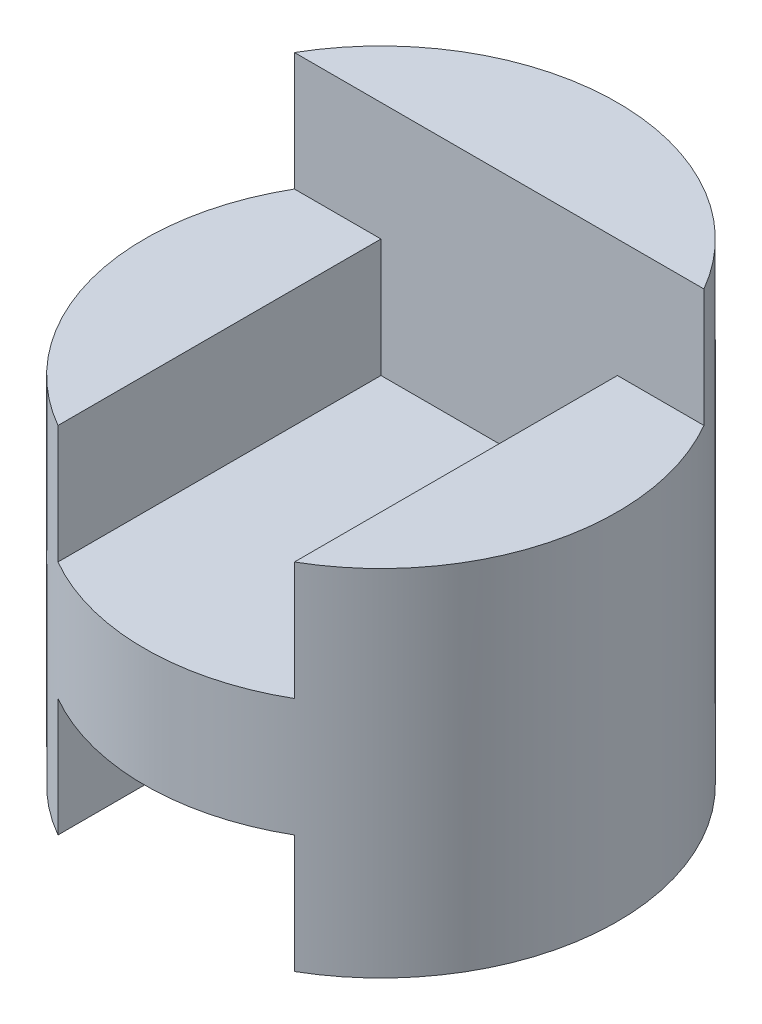
ISO-10303-21;
HEADER;
FILE_DESCRIPTION(('STEP AP214'),'2;1');
FILE_NAME('part.step','',(''),(''),'','','');
FILE_SCHEMA(('AUTOMOTIVE_DESIGN { 1 0 10303 214 1 1 1 1 }'));
ENDSEC;
DATA;
#1=APPLICATION_CONTEXT('core data for automotive mechanical design processes');
#2=APPLICATION_PROTOCOL_DEFINITION('international standard','automotive_design',2000,#1);
#3=PRODUCT_CONTEXT('',#1,'mechanical');
#4=PRODUCT('Part','Part','',(#3));
#5=PRODUCT_RELATED_PRODUCT_CATEGORY('part','',(#4));
#6=PRODUCT_DEFINITION_FORMATION('','',#4);
#7=PRODUCT_DEFINITION_CONTEXT('part definition',#1,'design');
#8=PRODUCT_DEFINITION('design','',#6,#7);
#9=PRODUCT_DEFINITION_SHAPE('','',#8);
#10=(LENGTH_UNIT() NAMED_UNIT(*) SI_UNIT(.MILLI.,.METRE.));
#11=(NAMED_UNIT(*) PLANE_ANGLE_UNIT() SI_UNIT($,.RADIAN.));
#12=(NAMED_UNIT(*) SI_UNIT($,.STERADIAN.) SOLID_ANGLE_UNIT());
#13=UNCERTAINTY_MEASURE_WITH_UNIT(LENGTH_MEASURE(1.E-05),#10,'distance_accuracy_value','');
#14=(GEOMETRIC_REPRESENTATION_CONTEXT(3) GLOBAL_UNCERTAINTY_ASSIGNED_CONTEXT((#13)) GLOBAL_UNIT_ASSIGNED_CONTEXT((#10,
#11,#12)) REPRESENTATION_CONTEXT('',''));
#15=CARTESIAN_POINT('',(0.,0.,0.));
#16=DIRECTION('',(0.,0.,1.));
#17=DIRECTION('',(1.,0.,0.));
#18=AXIS2_PLACEMENT_3D('',#15,#16,#17);
#19=CARTESIAN_POINT('',(0.,4.,0.));
#20=DIRECTION('',(0.,-1.,0.));
#21=DIRECTION('',(0.,0.,-1.));
#22=AXIS2_PLACEMENT_3D('',#19,#20,#21);
#23=CYLINDRICAL_SURFACE('',#22,2.);
#24=DIRECTION('',(0.,-1.,0.));
#25=VECTOR('',#24,1.);
#26=CARTESIAN_POINT('',(-1.,4.,1.73205080756888));
#27=LINE('',#26,#25);
#28=CARTESIAN_POINT('',(-1.,1.,1.73205080756888));
#29=VERTEX_POINT('',#28);
#30=CARTESIAN_POINT('',(-1.,0.,1.73205080756888));
#31=VERTEX_POINT('',#30);
#32=EDGE_CURVE('E160',#29,#31,#27,.T.);
#33=ORIENTED_EDGE('',*,*,#32,.F.);
#34=CARTESIAN_POINT('',(0.,1.,0.));
#35=DIRECTION('',(0.,-1.,0.));
#36=DIRECTION('',(0.,0.,-1.));
#37=AXIS2_PLACEMENT_3D('',#34,#35,#36);
#38=CIRCLE('',#37,2.);
#39=CARTESIAN_POINT('',(1.,1.,1.73205080756888));
#40=VERTEX_POINT('',#39);
#41=EDGE_CURVE('E176',#40,#29,#38,.T.);
#42=ORIENTED_EDGE('',*,*,#41,.F.);
#43=DIRECTION('',(0.,-1.,0.));
#44=VECTOR('',#43,1.);
#45=CARTESIAN_POINT('',(0.999999999999999,4.,1.73205080756888));
#46=LINE('',#45,#44);
#47=CARTESIAN_POINT('',(1.,0.,1.73205080756888));
#48=VERTEX_POINT('',#47);
#49=EDGE_CURVE('E120',#48,#40,#46,.F.);
#50=ORIENTED_EDGE('',*,*,#49,.F.);
#51=CARTESIAN_POINT('',(0.,0.,0.));
#52=DIRECTION('',(0.,1.,0.));
#53=DIRECTION('',(0.,0.,1.));
#54=AXIS2_PLACEMENT_3D('',#51,#52,#53);
#55=CIRCLE('',#54,2.);
#56=EDGE_CURVE('E164',#48,#31,#55,.T.);
#57=ORIENTED_EDGE('',*,*,#56,.T.);
#58=EDGE_LOOP('',(#33,#42,#50,#57));
#59=FACE_BOUND('',#58,.T.);
#60=DIRECTION('',(0.,-1.,0.));
#61=VECTOR('',#60,1.);
#62=CARTESIAN_POINT('',(1.73205080756888,4.,-1.));
#63=LINE('',#62,#61);
#64=CARTESIAN_POINT('',(1.73205080756888,4.,-1.));
#65=VERTEX_POINT('',#64);
#66=CARTESIAN_POINT('',(1.73205080756888,3.,-1.));
#67=VERTEX_POINT('',#66);
#68=EDGE_CURVE('E47',#65,#67,#63,.T.);
#69=ORIENTED_EDGE('',*,*,#68,.T.);
#70=CARTESIAN_POINT('',(0.,3.,0.));
#71=DIRECTION('',(0.,1.,0.));
#72=DIRECTION('',(0.,0.,1.));
#73=AXIS2_PLACEMENT_3D('',#70,#71,#72);
#74=CIRCLE('',#73,2.);
#75=CARTESIAN_POINT('',(1.,3.,1.73205080756888));
#76=VERTEX_POINT('',#75);
#77=EDGE_CURVE('E11',#76,#67,#74,.T.);
#78=ORIENTED_EDGE('',*,*,#77,.F.);
#79=DIRECTION('',(0.,-1.,0.));
#80=VECTOR('',#79,1.);
#81=CARTESIAN_POINT('',(1.,4.,1.73205080756888));
#82=LINE('',#81,#80);
#83=CARTESIAN_POINT('',(1.,2.,1.73205080756888));
#84=VERTEX_POINT('',#83);
#85=EDGE_CURVE('E40',#84,#76,#82,.F.);
#86=ORIENTED_EDGE('',*,*,#85,.F.);
#87=CARTESIAN_POINT('',(0.,2.,0.));
#88=DIRECTION('',(0.,1.,0.));
#89=DIRECTION('',(-1.,0.,0.));
#90=AXIS2_PLACEMENT_3D('',#87,#88,#89);
#91=CIRCLE('',#90,2.);
#92=CARTESIAN_POINT('',(-1.,2.,1.73205080756888));
#93=VERTEX_POINT('',#92);
#94=EDGE_CURVE('E181',#93,#84,#91,.T.);
#95=ORIENTED_EDGE('',*,*,#94,.F.);
#96=DIRECTION('',(0.,-1.,0.));
#97=VECTOR('',#96,1.);
#98=CARTESIAN_POINT('',(-1.,4.,1.73205080756888));
#99=LINE('',#98,#97);
#100=CARTESIAN_POINT('',(-1.,3.,1.73205080756888));
#101=VERTEX_POINT('',#100);
#102=EDGE_CURVE('E179',#101,#93,#99,.T.);
#103=ORIENTED_EDGE('',*,*,#102,.F.);
#104=CARTESIAN_POINT('',(0.,3.,0.));
#105=DIRECTION('',(0.,1.,0.));
#106=DIRECTION('',(-1.,0.,0.));
#107=AXIS2_PLACEMENT_3D('',#104,#105,#106);
#108=CIRCLE('',#107,2.);
#109=CARTESIAN_POINT('',(-1.73205080756888,3.,-1.));
#110=VERTEX_POINT('',#109);
#111=EDGE_CURVE('E116',#110,#101,#108,.T.);
#112=ORIENTED_EDGE('',*,*,#111,.F.);
#113=DIRECTION('',(0.,-1.,0.));
#114=VECTOR('',#113,1.);
#115=CARTESIAN_POINT('',(-1.73205080756888,4.,-1.));
#116=LINE('',#115,#114);
#117=CARTESIAN_POINT('',(-1.73205080756888,4.,-1.));
#118=VERTEX_POINT('',#117);
#119=EDGE_CURVE('E128',#110,#118,#116,.F.);
#120=ORIENTED_EDGE('',*,*,#119,.T.);
#121=CARTESIAN_POINT('',(0.,4.,0.));
#122=DIRECTION('',(0.,1.,0.));
#123=DIRECTION('',(0.,0.,1.));
#124=AXIS2_PLACEMENT_3D('',#121,#122,#123);
#125=CIRCLE('',#124,2.);
#126=EDGE_CURVE('E165',#65,#118,#125,.T.);
#127=ORIENTED_EDGE('',*,*,#126,.F.);
#128=EDGE_LOOP('',(#69,#78,#86,#95,#103,#112,#120,#127));
#129=FACE_BOUND('',#128,.T.);
#130=ADVANCED_FACE('F33',(#59,#129),#23,.T.);
#131=CARTESIAN_POINT('',(0.,0.,0.));
#132=DIRECTION('',(0.,1.,0.));
#133=DIRECTION('',(0.,0.,1.));
#134=AXIS2_PLACEMENT_3D('',#131,#132,#133);
#135=PLANE('',#134);
#136=DIRECTION('',(0.,0.,-1.));
#137=VECTOR('',#136,1.);
#138=CARTESIAN_POINT('',(-1.,0.,0.));
#139=LINE('',#138,#137);
#140=CARTESIAN_POINT('',(-1.,0.,-1.));
#141=VERTEX_POINT('',#140);
#142=EDGE_CURVE('E172',#31,#141,#139,.T.);
#143=ORIENTED_EDGE('',*,*,#142,.F.);
#144=ORIENTED_EDGE('',*,*,#56,.F.);
#145=DIRECTION('',(0.,0.,1.));
#146=VECTOR('',#145,1.);
#147=CARTESIAN_POINT('',(1.,0.,0.));
#148=LINE('',#147,#146);
#149=CARTESIAN_POINT('',(1.,0.,-1.));
#150=VERTEX_POINT('',#149);
#151=EDGE_CURVE('E168',#150,#48,#148,.T.);
#152=ORIENTED_EDGE('',*,*,#151,.F.);
#153=DIRECTION('',(1.,0.,0.));
#154=VECTOR('',#153,1.);
#155=CARTESIAN_POINT('',(-1.,0.,-1.));
#156=LINE('',#155,#154);
#157=EDGE_CURVE('E149',#141,#150,#156,.T.);
#158=ORIENTED_EDGE('',*,*,#157,.F.);
#159=EDGE_LOOP('',(#143,#144,#152,#158));
#160=FACE_BOUND('',#159,.T.);
#161=ADVANCED_FACE('F199',(#160),#135,.F.);
#162=CARTESIAN_POINT('',(0.,4.,0.));
#163=DIRECTION('',(0.,1.,0.));
#164=DIRECTION('',(0.,0.,1.));
#165=AXIS2_PLACEMENT_3D('',#162,#163,#164);
#166=PLANE('',#165);
#167=DIRECTION('',(-1.,0.,0.));
#168=VECTOR('',#167,1.);
#169=CARTESIAN_POINT('',(0.,4.,-1.));
#170=LINE('',#169,#168);
#171=EDGE_CURVE('E174',#65,#118,#170,.T.);
#172=ORIENTED_EDGE('',*,*,#171,.F.);
#173=ORIENTED_EDGE('',*,*,#126,.T.);
#174=EDGE_LOOP('',(#172,#173));
#175=FACE_BOUND('',#174,.T.);
#176=ADVANCED_FACE('F196',(#175),#166,.T.);
#177=CARTESIAN_POINT('',(-1.,1.,3.));
#178=DIRECTION('',(0.,-1.,0.));
#179=DIRECTION('',(0.,0.,-1.));
#180=AXIS2_PLACEMENT_3D('',#177,#178,#179);
#181=PLANE('',#180);
#182=ORIENTED_EDGE('',*,*,#41,.T.);
#183=DIRECTION('',(0.,0.,-1.));
#184=VECTOR('',#183,1.);
#185=CARTESIAN_POINT('',(-1.,1.,3.));
#186=LINE('',#185,#184);
#187=CARTESIAN_POINT('',(-1.,1.,-1.));
#188=VERTEX_POINT('',#187);
#189=EDGE_CURVE('E156',#29,#188,#186,.T.);
#190=ORIENTED_EDGE('',*,*,#189,.T.);
#191=DIRECTION('',(-1.,0.,0.));
#192=VECTOR('',#191,1.);
#193=CARTESIAN_POINT('',(-1.,1.,-1.));
#194=LINE('',#193,#192);
#195=CARTESIAN_POINT('',(1.,1.,-1.));
#196=VERTEX_POINT('',#195);
#197=EDGE_CURVE('E154',#196,#188,#194,.T.);
#198=ORIENTED_EDGE('',*,*,#197,.F.);
#199=DIRECTION('',(0.,0.,-1.));
#200=VECTOR('',#199,1.);
#201=CARTESIAN_POINT('',(1.,1.,3.));
#202=LINE('',#201,#200);
#203=EDGE_CURVE('E129',#40,#196,#202,.T.);
#204=ORIENTED_EDGE('',*,*,#203,.F.);
#205=EDGE_LOOP('',(#182,#190,#198,#204));
#206=FACE_BOUND('',#205,.T.);
#207=ADVANCED_FACE('F198',(#206),#181,.T.);
#208=CARTESIAN_POINT('',(-1.,0.,3.));
#209=DIRECTION('',(1.,0.,0.));
#210=DIRECTION('',(0.,0.,-1.));
#211=AXIS2_PLACEMENT_3D('',#208,#209,#210);
#212=PLANE('',#211);
#213=ORIENTED_EDGE('',*,*,#32,.T.);
#214=ORIENTED_EDGE('',*,*,#142,.T.);
#215=DIRECTION('',(0.,-1.,0.));
#216=VECTOR('',#215,1.);
#217=CARTESIAN_POINT('',(-1.,0.,-1.));
#218=LINE('',#217,#216);
#219=EDGE_CURVE('E55',#188,#141,#218,.T.);
#220=ORIENTED_EDGE('',*,*,#219,.F.);
#221=ORIENTED_EDGE('',*,*,#189,.F.);
#222=EDGE_LOOP('',(#213,#214,#220,#221));
#223=FACE_BOUND('',#222,.T.);
#224=ADVANCED_FACE('F205',(#223),#212,.T.);
#225=CARTESIAN_POINT('',(1.,0.,3.));
#226=DIRECTION('',(-1.,0.,0.));
#227=DIRECTION('',(0.,-1.,0.));
#228=AXIS2_PLACEMENT_3D('',#225,#226,#227);
#229=PLANE('',#228);
#230=ORIENTED_EDGE('',*,*,#49,.T.);
#231=ORIENTED_EDGE('',*,*,#203,.T.);
#232=DIRECTION('',(0.,1.,0.));
#233=VECTOR('',#232,1.);
#234=CARTESIAN_POINT('',(1.,0.,-1.));
#235=LINE('',#234,#233);
#236=EDGE_CURVE('E151',#150,#196,#235,.T.);
#237=ORIENTED_EDGE('',*,*,#236,.F.);
#238=ORIENTED_EDGE('',*,*,#151,.T.);
#239=EDGE_LOOP('',(#230,#231,#237,#238));
#240=FACE_BOUND('',#239,.T.);
#241=ADVANCED_FACE('F227',(#240),#229,.T.);
#242=CARTESIAN_POINT('',(0.,0.,-1.));
#243=DIRECTION('',(0.,0.,-1.));
#244=DIRECTION('',(-1.,0.,0.));
#245=AXIS2_PLACEMENT_3D('',#242,#243,#244);
#246=PLANE('',#245);
#247=ORIENTED_EDGE('',*,*,#219,.T.);
#248=ORIENTED_EDGE('',*,*,#157,.T.);
#249=ORIENTED_EDGE('',*,*,#236,.T.);
#250=ORIENTED_EDGE('',*,*,#197,.T.);
#251=EDGE_LOOP('',(#247,#248,#249,#250));
#252=FACE_BOUND('',#251,.T.);
#253=ADVANCED_FACE('F223',(#252),#246,.F.);
#254=CARTESIAN_POINT('',(-1.,3.,3.));
#255=DIRECTION('',(0.,1.,0.));
#256=DIRECTION('',(-1.,0.,0.));
#257=AXIS2_PLACEMENT_3D('',#254,#255,#256);
#258=PLANE('',#257);
#259=ORIENTED_EDGE('',*,*,#111,.T.);
#260=DIRECTION('',(0.,0.,-1.));
#261=VECTOR('',#260,1.);
#262=CARTESIAN_POINT('',(-1.,3.,3.));
#263=LINE('',#262,#261);
#264=CARTESIAN_POINT('',(-1.,3.,-1.));
#265=VERTEX_POINT('',#264);
#266=EDGE_CURVE('E111',#101,#265,#263,.T.);
#267=ORIENTED_EDGE('',*,*,#266,.T.);
#268=DIRECTION('',(1.,0.,0.));
#269=VECTOR('',#268,1.);
#270=CARTESIAN_POINT('',(-1.,3.,-1.));
#271=LINE('',#270,#269);
#272=EDGE_CURVE('E114',#110,#265,#271,.T.);
#273=ORIENTED_EDGE('',*,*,#272,.F.);
#274=EDGE_LOOP('',(#259,#267,#273));
#275=FACE_BOUND('',#274,.T.);
#276=ADVANCED_FACE('F113',(#275),#258,.T.);
#277=CARTESIAN_POINT('',(-1.,2.,3.));
#278=DIRECTION('',(1.,0.,0.));
#279=DIRECTION('',(0.,0.,-1.));
#280=AXIS2_PLACEMENT_3D('',#277,#278,#279);
#281=PLANE('',#280);
#282=ORIENTED_EDGE('',*,*,#102,.T.);
#283=DIRECTION('',(0.,0.,-1.));
#284=VECTOR('',#283,1.);
#285=CARTESIAN_POINT('',(-1.,2.,3.));
#286=LINE('',#285,#284);
#287=CARTESIAN_POINT('',(-1.,2.,-1.));
#288=VERTEX_POINT('',#287);
#289=EDGE_CURVE('E121',#93,#288,#286,.T.);
#290=ORIENTED_EDGE('',*,*,#289,.T.);
#291=DIRECTION('',(0.,-1.,0.));
#292=VECTOR('',#291,1.);
#293=CARTESIAN_POINT('',(-1.,2.,-1.));
#294=LINE('',#293,#292);
#295=EDGE_CURVE('E126',#265,#288,#294,.T.);
#296=ORIENTED_EDGE('',*,*,#295,.F.);
#297=ORIENTED_EDGE('',*,*,#266,.F.);
#298=EDGE_LOOP('',(#282,#290,#296,#297));
#299=FACE_BOUND('',#298,.T.);
#300=ADVANCED_FACE('F131',(#299),#281,.T.);
#301=CARTESIAN_POINT('',(1.,2.,3.));
#302=DIRECTION('',(0.,1.,0.));
#303=DIRECTION('',(-1.,0.,0.));
#304=AXIS2_PLACEMENT_3D('',#301,#302,#303);
#305=PLANE('',#304);
#306=ORIENTED_EDGE('',*,*,#94,.T.);
#307=DIRECTION('',(0.,0.,-1.));
#308=VECTOR('',#307,1.);
#309=CARTESIAN_POINT('',(1.,2.,3.));
#310=LINE('',#309,#308);
#311=CARTESIAN_POINT('',(1.,2.,-1.));
#312=VERTEX_POINT('',#311);
#313=EDGE_CURVE('E145',#84,#312,#310,.T.);
#314=ORIENTED_EDGE('',*,*,#313,.T.);
#315=DIRECTION('',(1.,0.,0.));
#316=VECTOR('',#315,1.);
#317=CARTESIAN_POINT('',(1.,2.,-1.));
#318=LINE('',#317,#316);
#319=EDGE_CURVE('E134',#288,#312,#318,.T.);
#320=ORIENTED_EDGE('',*,*,#319,.F.);
#321=ORIENTED_EDGE('',*,*,#289,.F.);
#322=EDGE_LOOP('',(#306,#314,#320,#321));
#323=FACE_BOUND('',#322,.T.);
#324=ADVANCED_FACE('F240',(#323),#305,.T.);
#325=CARTESIAN_POINT('',(1.,3.,3.));
#326=DIRECTION('',(-1.,0.,0.));
#327=DIRECTION('',(0.,-1.,0.));
#328=AXIS2_PLACEMENT_3D('',#325,#326,#327);
#329=PLANE('',#328);
#330=ORIENTED_EDGE('',*,*,#85,.T.);
#331=DIRECTION('',(0.,0.,-1.));
#332=VECTOR('',#331,1.);
#333=CARTESIAN_POINT('',(1.,3.,3.));
#334=LINE('',#333,#332);
#335=CARTESIAN_POINT('',(1.,3.,-1.));
#336=VERTEX_POINT('',#335);
#337=EDGE_CURVE('E143',#76,#336,#334,.T.);
#338=ORIENTED_EDGE('',*,*,#337,.T.);
#339=DIRECTION('',(0.,1.,0.));
#340=VECTOR('',#339,1.);
#341=CARTESIAN_POINT('',(1.,3.,-1.));
#342=LINE('',#341,#340);
#343=EDGE_CURVE('E136',#312,#336,#342,.T.);
#344=ORIENTED_EDGE('',*,*,#343,.F.);
#345=ORIENTED_EDGE('',*,*,#313,.F.);
#346=EDGE_LOOP('',(#330,#338,#344,#345));
#347=FACE_BOUND('',#346,.T.);
#348=ADVANCED_FACE('F186',(#347),#329,.T.);
#349=CARTESIAN_POINT('',(2.,3.,3.));
#350=DIRECTION('',(0.,1.,0.));
#351=DIRECTION('',(0.,0.,1.));
#352=AXIS2_PLACEMENT_3D('',#349,#350,#351);
#353=PLANE('',#352);
#354=ORIENTED_EDGE('',*,*,#77,.T.);
#355=DIRECTION('',(1.,0.,0.));
#356=VECTOR('',#355,1.);
#357=CARTESIAN_POINT('',(2.,3.,-1.));
#358=LINE('',#357,#356);
#359=EDGE_CURVE('E141',#336,#67,#358,.T.);
#360=ORIENTED_EDGE('',*,*,#359,.F.);
#361=ORIENTED_EDGE('',*,*,#337,.F.);
#362=EDGE_LOOP('',(#354,#360,#361));
#363=FACE_BOUND('',#362,.T.);
#364=ADVANCED_FACE('F193',(#363),#353,.T.);
#365=CARTESIAN_POINT('',(0.,0.,-1.));
#366=DIRECTION('',(0.,0.,-1.));
#367=DIRECTION('',(-1.,0.,0.));
#368=AXIS2_PLACEMENT_3D('',#365,#366,#367);
#369=PLANE('',#368);
#370=ORIENTED_EDGE('',*,*,#171,.T.);
#371=ORIENTED_EDGE('',*,*,#119,.F.);
#372=ORIENTED_EDGE('',*,*,#272,.T.);
#373=ORIENTED_EDGE('',*,*,#295,.T.);
#374=ORIENTED_EDGE('',*,*,#319,.T.);
#375=ORIENTED_EDGE('',*,*,#343,.T.);
#376=ORIENTED_EDGE('',*,*,#359,.T.);
#377=ORIENTED_EDGE('',*,*,#68,.F.);
#378=EDGE_LOOP('',(#370,#371,#372,#373,#374,#375,#376,#377));
#379=FACE_BOUND('',#378,.T.);
#380=ADVANCED_FACE('F124',(#379),#369,.F.);
#381=CLOSED_SHELL('',(#130,#161,#176,#207,#224,#241,#253,#276,#300,#324,#348,#364,#380));
#382=MANIFOLD_SOLID_BREP('B2',#381);
#383=ADVANCED_BREP_SHAPE_REPRESENTATION('',(#18,#382),#14);
#384=SHAPE_DEFINITION_REPRESENTATION(#9,#383);
ENDSEC;
END-ISO-10303-21;
